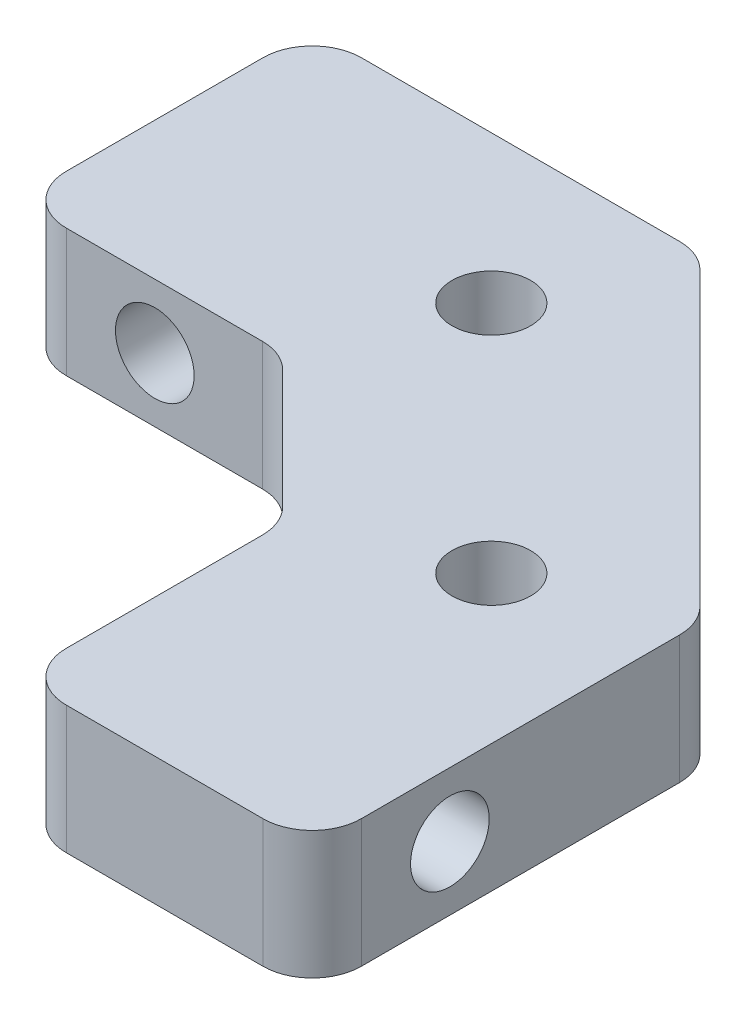
ISO-10303-21;
HEADER;
FILE_DESCRIPTION(('STEP AP214'),'2;1');
FILE_NAME('part.step','',(''),(''),'','','');
FILE_SCHEMA(('AUTOMOTIVE_DESIGN { 1 0 10303 214 1 1 1 1 }'));
ENDSEC;
DATA;
#1=APPLICATION_CONTEXT('core data for automotive mechanical design processes');
#2=APPLICATION_PROTOCOL_DEFINITION('international standard','automotive_design',2000,#1);
#3=PRODUCT_CONTEXT('',#1,'mechanical');
#4=PRODUCT('Part','Part','',(#3));
#5=PRODUCT_RELATED_PRODUCT_CATEGORY('part','',(#4));
#6=PRODUCT_DEFINITION_FORMATION('','',#4);
#7=PRODUCT_DEFINITION_CONTEXT('part definition',#1,'design');
#8=PRODUCT_DEFINITION('design','',#6,#7);
#9=PRODUCT_DEFINITION_SHAPE('','',#8);
#10=(LENGTH_UNIT() NAMED_UNIT(*) SI_UNIT(.MILLI.,.METRE.));
#11=(NAMED_UNIT(*) PLANE_ANGLE_UNIT() SI_UNIT($,.RADIAN.));
#12=(NAMED_UNIT(*) SI_UNIT($,.STERADIAN.) SOLID_ANGLE_UNIT());
#13=UNCERTAINTY_MEASURE_WITH_UNIT(LENGTH_MEASURE(1.E-05),#10,'distance_accuracy_value','');
#14=(GEOMETRIC_REPRESENTATION_CONTEXT(3) GLOBAL_UNCERTAINTY_ASSIGNED_CONTEXT((#13)) GLOBAL_UNIT_ASSIGNED_CONTEXT((#10,
#11,#12)) REPRESENTATION_CONTEXT('',''));
#15=CARTESIAN_POINT('',(0.,0.,0.));
#16=DIRECTION('',(0.,0.,1.));
#17=DIRECTION('',(1.,0.,0.));
#18=AXIS2_PLACEMENT_3D('',#15,#16,#17);
#19=CARTESIAN_POINT('',(-42.,13.,0.));
#20=DIRECTION('',(0.,-1.,0.));
#21=DIRECTION('',(0.,0.,-1.));
#22=AXIS2_PLACEMENT_3D('',#19,#20,#21);
#23=PLANE('',#22);
#24=CARTESIAN_POINT('',(-8.78679656440375,13.,-15.0000000000002));
#25=DIRECTION('',(0.,1.,0.));
#26=DIRECTION('',(0.,0.,1.));
#27=AXIS2_PLACEMENT_3D('',#24,#25,#26);
#28=CIRCLE('',#27,4.);
#29=CARTESIAN_POINT('',(-8.78679656440375,13.,-11.0000000000002));
#30=VERTEX_POINT('',#29);
#31=EDGE_CURVE('E280',#30,#30,#28,.T.);
#32=ORIENTED_EDGE('',*,*,#31,.F.);
#33=EDGE_LOOP('',(#32));
#34=FACE_BOUND('',#33,.T.);
#35=DIRECTION('',(0.,0.,1.));
#36=VECTOR('',#35,1.);
#37=CARTESIAN_POINT('',(0.,13.,42.));
#38=LINE('',#37,#36);
#39=CARTESIAN_POINT('',(0.,13.,17.0710678118655));
#40=VERTEX_POINT('',#39);
#41=CARTESIAN_POINT('',(0.,13.,37.0000000000001));
#42=VERTEX_POINT('',#41);
#43=EDGE_CURVE('E261',#40,#42,#38,.T.);
#44=ORIENTED_EDGE('',*,*,#43,.T.);
#45=CARTESIAN_POINT('',(5.,13.,37.0000000000001));
#46=DIRECTION('',(0.,-1.,0.));
#47=DIRECTION('',(0.,0.,-1.));
#48=AXIS2_PLACEMENT_3D('',#45,#46,#47);
#49=CIRCLE('',#48,5.);
#50=CARTESIAN_POINT('',(4.99999999999991,13.,42.0000000000001));
#51=VERTEX_POINT('',#50);
#52=EDGE_CURVE('E212',#42,#51,#49,.F.);
#53=ORIENTED_EDGE('',*,*,#52,.T.);
#54=DIRECTION('',(1.,0.,0.));
#55=VECTOR('',#54,1.);
#56=CARTESIAN_POINT('',(0.,13.,42.));
#57=LINE('',#56,#55);
#58=CARTESIAN_POINT('',(24.9999999999993,13.,42.0000000000005));
#59=VERTEX_POINT('',#58);
#60=EDGE_CURVE('E165',#51,#59,#57,.T.);
#61=ORIENTED_EDGE('',*,*,#60,.T.);
#62=CARTESIAN_POINT('',(24.9999999999994,13.,37.0000000000005));
#63=DIRECTION('',(0.,-1.,0.));
#64=DIRECTION('',(0.,0.,-1.));
#65=AXIS2_PLACEMENT_3D('',#62,#63,#64);
#66=CIRCLE('',#65,5.);
#67=CARTESIAN_POINT('',(29.9999999999994,13.,37.0000000000005));
#68=VERTEX_POINT('',#67);
#69=EDGE_CURVE('E210',#59,#68,#66,.F.);
#70=ORIENTED_EDGE('',*,*,#69,.T.);
#71=DIRECTION('',(0.,0.,-1.));
#72=VECTOR('',#71,1.);
#73=CARTESIAN_POINT('',(29.9999999999994,13.,2.5735931288066));
#74=LINE('',#73,#72);
#75=CARTESIAN_POINT('',(29.9999999999994,13.,4.64466094067208));
#76=VERTEX_POINT('',#75);
#77=EDGE_CURVE('E266',#68,#76,#74,.T.);
#78=ORIENTED_EDGE('',*,*,#77,.T.);
#79=CARTESIAN_POINT('',(24.9999999999994,13.,4.64466094067208));
#80=DIRECTION('',(0.,-1.,0.));
#81=DIRECTION('',(0.,0.,-1.));
#82=AXIS2_PLACEMENT_3D('',#79,#80,#81);
#83=CIRCLE('',#82,5.);
#84=CARTESIAN_POINT('',(28.5355339059322,13.,1.10912703473934));
#85=VERTEX_POINT('',#84);
#86=EDGE_CURVE('E208',#76,#85,#83,.F.);
#87=ORIENTED_EDGE('',*,*,#86,.T.);
#88=DIRECTION('',(-0.707106781186548,0.,-0.707106781186548));
#89=VECTOR('',#88,1.);
#90=CARTESIAN_POINT('',(-2.57359312880715,13.,-30.));
#91=LINE('',#90,#89);
#92=CARTESIAN_POINT('',(-1.10912703473989,13.,-28.5355339059327));
#93=VERTEX_POINT('',#92);
#94=EDGE_CURVE('E273',#85,#93,#91,.T.);
#95=ORIENTED_EDGE('',*,*,#94,.T.);
#96=CARTESIAN_POINT('',(-4.64466094067263,13.,-25.));
#97=DIRECTION('',(0.,-1.,0.));
#98=DIRECTION('',(0.,0.,-1.));
#99=AXIS2_PLACEMENT_3D('',#96,#97,#98);
#100=CIRCLE('',#99,5.);
#101=CARTESIAN_POINT('',(-4.64466094067263,13.,-30.));
#102=VERTEX_POINT('',#101);
#103=EDGE_CURVE('E206',#93,#102,#100,.F.);
#104=ORIENTED_EDGE('',*,*,#103,.T.);
#105=DIRECTION('',(-1.,0.,0.));
#106=VECTOR('',#105,1.);
#107=CARTESIAN_POINT('',(-42.,13.,-30.));
#108=LINE('',#107,#106);
#109=CARTESIAN_POINT('',(-37.,13.,-30.));
#110=VERTEX_POINT('',#109);
#111=EDGE_CURVE('E276',#102,#110,#108,.T.);
#112=ORIENTED_EDGE('',*,*,#111,.T.);
#113=CARTESIAN_POINT('',(-37.,13.,-25.));
#114=DIRECTION('',(0.,-1.,0.));
#115=DIRECTION('',(0.,0.,-1.));
#116=AXIS2_PLACEMENT_3D('',#113,#114,#115);
#117=CIRCLE('',#116,5.);
#118=CARTESIAN_POINT('',(-42.,13.,-25.));
#119=VERTEX_POINT('',#118);
#120=EDGE_CURVE('E53',#110,#119,#117,.F.);
#121=ORIENTED_EDGE('',*,*,#120,.T.);
#122=DIRECTION('',(0.,0.,1.));
#123=VECTOR('',#122,1.);
#124=CARTESIAN_POINT('',(-42.,13.,0.));
#125=LINE('',#124,#123);
#126=CARTESIAN_POINT('',(-42.,13.,-5.00000000000006));
#127=VERTEX_POINT('',#126);
#128=EDGE_CURVE('E190',#119,#127,#125,.T.);
#129=ORIENTED_EDGE('',*,*,#128,.T.);
#130=CARTESIAN_POINT('',(-37.,13.,-5.00000000000006));
#131=DIRECTION('',(0.,-1.,0.));
#132=DIRECTION('',(0.,0.,-1.));
#133=AXIS2_PLACEMENT_3D('',#130,#131,#132);
#134=CIRCLE('',#133,5.);
#135=CARTESIAN_POINT('',(-36.9999999999999,13.,0.));
#136=VERTEX_POINT('',#135);
#137=EDGE_CURVE('E203',#127,#136,#134,.F.);
#138=ORIENTED_EDGE('',*,*,#137,.T.);
#139=DIRECTION('',(1.,0.,0.));
#140=VECTOR('',#139,1.);
#141=CARTESIAN_POINT('',(-15.0000000000004,13.,-3.54334807611323E-13));
#142=LINE('',#141,#140);
#143=CARTESIAN_POINT('',(-17.0710678118659,13.,-3.26760585898465E-13));
#144=VERTEX_POINT('',#143);
#145=EDGE_CURVE('E189',#136,#144,#142,.T.);
#146=ORIENTED_EDGE('',*,*,#145,.T.);
#147=CARTESIAN_POINT('',(-17.0710678118658,13.,4.99999999999967));
#148=DIRECTION('',(0.,-1.,0.));
#149=DIRECTION('',(0.,0.,-1.));
#150=AXIS2_PLACEMENT_3D('',#147,#148,#149);
#151=CIRCLE('',#150,5.);
#152=CARTESIAN_POINT('',(-13.5355339059331,13.,1.46446609406693));
#153=VERTEX_POINT('',#152);
#154=EDGE_CURVE('E245',#144,#153,#151,.T.);
#155=ORIENTED_EDGE('',*,*,#154,.T.);
#156=DIRECTION('',(0.707106781186548,0.,0.707106781186547));
#157=VECTOR('',#156,1.);
#158=CARTESIAN_POINT('',(0.,13.,15.));
#159=LINE('',#158,#157);
#160=CARTESIAN_POINT('',(-1.46446609406726,13.,13.5355339059327));
#161=VERTEX_POINT('',#160);
#162=EDGE_CURVE('E262',#153,#161,#159,.T.);
#163=ORIENTED_EDGE('',*,*,#162,.T.);
#164=CARTESIAN_POINT('',(-5.,13.,17.0710678118655));
#165=DIRECTION('',(0.,-1.,0.));
#166=DIRECTION('',(0.,0.,-1.));
#167=AXIS2_PLACEMENT_3D('',#164,#165,#166);
#168=CIRCLE('',#167,5.);
#169=EDGE_CURVE('E11',#161,#40,#168,.T.);
#170=ORIENTED_EDGE('',*,*,#169,.T.);
#171=EDGE_LOOP('',(#44,#53,#61,#70,#78,#87,#95,#104,#112,#121,#129,#138,#146,#155,#163,#170));
#172=FACE_BOUND('',#171,.T.);
#173=CARTESIAN_POINT('',(14.9999999999997,13.,8.7867965644033));
#174=DIRECTION('',(0.,1.,0.));
#175=DIRECTION('',(0.,0.,1.));
#176=AXIS2_PLACEMENT_3D('',#173,#174,#175);
#177=CIRCLE('',#176,4.);
#178=CARTESIAN_POINT('',(14.9999999999997,13.,12.7867965644033));
#179=VERTEX_POINT('',#178);
#180=EDGE_CURVE('E290',#179,#179,#177,.T.);
#181=ORIENTED_EDGE('',*,*,#180,.F.);
#182=EDGE_LOOP('',(#181));
#183=FACE_BOUND('',#182,.T.);
#184=ADVANCED_FACE('F31',(#34,#172,#183),#23,.F.);
#185=CARTESIAN_POINT('',(-42.,0.,0.));
#186=DIRECTION('',(0.,-1.,0.));
#187=DIRECTION('',(0.,0.,-1.));
#188=AXIS2_PLACEMENT_3D('',#185,#186,#187);
#189=PLANE('',#188);
#190=CARTESIAN_POINT('',(-8.78679656440375,0.,-15.0000000000002));
#191=DIRECTION('',(0.,1.,0.));
#192=DIRECTION('',(0.,0.,1.));
#193=AXIS2_PLACEMENT_3D('',#190,#191,#192);
#194=CIRCLE('',#193,4.);
#195=CARTESIAN_POINT('',(-8.78679656440375,0.,-11.0000000000002));
#196=VERTEX_POINT('',#195);
#197=EDGE_CURVE('E285',#196,#196,#194,.T.);
#198=ORIENTED_EDGE('',*,*,#197,.T.);
#199=EDGE_LOOP('',(#198));
#200=FACE_BOUND('',#199,.T.);
#201=DIRECTION('',(1.,0.,0.));
#202=VECTOR('',#201,1.);
#203=CARTESIAN_POINT('',(0.,0.,42.));
#204=LINE('',#203,#202);
#205=CARTESIAN_POINT('',(4.99999999999991,0.,42.0000000000001));
#206=VERTEX_POINT('',#205);
#207=CARTESIAN_POINT('',(24.9999999999993,0.,42.0000000000005));
#208=VERTEX_POINT('',#207);
#209=EDGE_CURVE('E162',#206,#208,#204,.T.);
#210=ORIENTED_EDGE('',*,*,#209,.F.);
#211=CARTESIAN_POINT('',(5.,0.,37.0000000000001));
#212=DIRECTION('',(0.,-1.,0.));
#213=DIRECTION('',(0.,0.,-1.));
#214=AXIS2_PLACEMENT_3D('',#211,#212,#213);
#215=CIRCLE('',#214,5.);
#216=CARTESIAN_POINT('',(0.,0.,37.0000000000001));
#217=VERTEX_POINT('',#216);
#218=EDGE_CURVE('E145',#206,#217,#215,.T.);
#219=ORIENTED_EDGE('',*,*,#218,.T.);
#220=DIRECTION('',(0.,0.,1.));
#221=VECTOR('',#220,1.);
#222=CARTESIAN_POINT('',(0.,0.,42.));
#223=LINE('',#222,#221);
#224=CARTESIAN_POINT('',(0.,0.,17.0710678118655));
#225=VERTEX_POINT('',#224);
#226=EDGE_CURVE('E173',#225,#217,#223,.T.);
#227=ORIENTED_EDGE('',*,*,#226,.F.);
#228=CARTESIAN_POINT('',(-5.,0.,17.0710678118655));
#229=DIRECTION('',(0.,-1.,0.));
#230=DIRECTION('',(0.,0.,-1.));
#231=AXIS2_PLACEMENT_3D('',#228,#229,#230);
#232=CIRCLE('',#231,5.);
#233=CARTESIAN_POINT('',(-1.46446609406726,0.,13.5355339059327));
#234=VERTEX_POINT('',#233);
#235=EDGE_CURVE('E39',#225,#234,#232,.F.);
#236=ORIENTED_EDGE('',*,*,#235,.T.);
#237=DIRECTION('',(0.707106781186548,0.,0.707106781186547));
#238=VECTOR('',#237,1.);
#239=CARTESIAN_POINT('',(0.,0.,15.));
#240=LINE('',#239,#238);
#241=CARTESIAN_POINT('',(-13.5355339059331,0.,1.46446609406693));
#242=VERTEX_POINT('',#241);
#243=EDGE_CURVE('E178',#242,#234,#240,.T.);
#244=ORIENTED_EDGE('',*,*,#243,.F.);
#245=CARTESIAN_POINT('',(-17.0710678118658,0.,4.99999999999967));
#246=DIRECTION('',(0.,-1.,0.));
#247=DIRECTION('',(0.,0.,-1.));
#248=AXIS2_PLACEMENT_3D('',#245,#246,#247);
#249=CIRCLE('',#248,5.);
#250=CARTESIAN_POINT('',(-17.0710678118659,0.,-3.26760585898465E-13));
#251=VERTEX_POINT('',#250);
#252=EDGE_CURVE('E243',#242,#251,#249,.F.);
#253=ORIENTED_EDGE('',*,*,#252,.T.);
#254=DIRECTION('',(1.,0.,0.));
#255=VECTOR('',#254,1.);
#256=CARTESIAN_POINT('',(-15.0000000000004,0.,-3.54334807611323E-13));
#257=LINE('',#256,#255);
#258=CARTESIAN_POINT('',(-36.9999999999999,0.,0.));
#259=VERTEX_POINT('',#258);
#260=EDGE_CURVE('E256',#259,#251,#257,.T.);
#261=ORIENTED_EDGE('',*,*,#260,.F.);
#262=CARTESIAN_POINT('',(-37.,0.,-5.00000000000006));
#263=DIRECTION('',(0.,-1.,0.));
#264=DIRECTION('',(0.,0.,-1.));
#265=AXIS2_PLACEMENT_3D('',#262,#263,#264);
#266=CIRCLE('',#265,5.);
#267=CARTESIAN_POINT('',(-42.,0.,-5.00000000000006));
#268=VERTEX_POINT('',#267);
#269=EDGE_CURVE('E166',#259,#268,#266,.T.);
#270=ORIENTED_EDGE('',*,*,#269,.T.);
#271=DIRECTION('',(0.,0.,1.));
#272=VECTOR('',#271,1.);
#273=CARTESIAN_POINT('',(-42.,0.,0.));
#274=LINE('',#273,#272);
#275=CARTESIAN_POINT('',(-42.,0.,-25.));
#276=VERTEX_POINT('',#275);
#277=EDGE_CURVE('E187',#276,#268,#274,.T.);
#278=ORIENTED_EDGE('',*,*,#277,.F.);
#279=CARTESIAN_POINT('',(-37.,0.,-25.));
#280=DIRECTION('',(0.,-1.,0.));
#281=DIRECTION('',(0.,0.,-1.));
#282=AXIS2_PLACEMENT_3D('',#279,#280,#281);
#283=CIRCLE('',#282,5.);
#284=CARTESIAN_POINT('',(-37.,0.,-30.));
#285=VERTEX_POINT('',#284);
#286=EDGE_CURVE('E193',#276,#285,#283,.T.);
#287=ORIENTED_EDGE('',*,*,#286,.T.);
#288=DIRECTION('',(-1.,0.,0.));
#289=VECTOR('',#288,1.);
#290=CARTESIAN_POINT('',(-42.,0.,-30.));
#291=LINE('',#290,#289);
#292=CARTESIAN_POINT('',(-4.64466094067263,0.,-30.));
#293=VERTEX_POINT('',#292);
#294=EDGE_CURVE('E184',#293,#285,#291,.T.);
#295=ORIENTED_EDGE('',*,*,#294,.F.);
#296=CARTESIAN_POINT('',(-4.64466094067263,0.,-25.));
#297=DIRECTION('',(0.,-1.,0.));
#298=DIRECTION('',(0.,0.,-1.));
#299=AXIS2_PLACEMENT_3D('',#296,#297,#298);
#300=CIRCLE('',#299,5.);
#301=CARTESIAN_POINT('',(-1.10912703473989,0.,-28.5355339059327));
#302=VERTEX_POINT('',#301);
#303=EDGE_CURVE('E195',#293,#302,#300,.T.);
#304=ORIENTED_EDGE('',*,*,#303,.T.);
#305=DIRECTION('',(-0.707106781186548,0.,-0.707106781186548));
#306=VECTOR('',#305,1.);
#307=CARTESIAN_POINT('',(-2.57359312880715,0.,-30.));
#308=LINE('',#307,#306);
#309=CARTESIAN_POINT('',(28.5355339059322,0.,1.10912703473934));
#310=VERTEX_POINT('',#309);
#311=EDGE_CURVE('E176',#310,#302,#308,.T.);
#312=ORIENTED_EDGE('',*,*,#311,.F.);
#313=CARTESIAN_POINT('',(24.9999999999994,0.,4.64466094067208));
#314=DIRECTION('',(0.,-1.,0.));
#315=DIRECTION('',(0.,0.,-1.));
#316=AXIS2_PLACEMENT_3D('',#313,#314,#315);
#317=CIRCLE('',#316,5.);
#318=CARTESIAN_POINT('',(29.9999999999994,0.,4.64466094067208));
#319=VERTEX_POINT('',#318);
#320=EDGE_CURVE('E197',#310,#319,#317,.T.);
#321=ORIENTED_EDGE('',*,*,#320,.T.);
#322=DIRECTION('',(0.,0.,-1.));
#323=VECTOR('',#322,1.);
#324=CARTESIAN_POINT('',(29.9999999999994,0.,2.5735931288066));
#325=LINE('',#324,#323);
#326=CARTESIAN_POINT('',(29.9999999999994,0.,37.0000000000005));
#327=VERTEX_POINT('',#326);
#328=EDGE_CURVE('E172',#327,#319,#325,.T.);
#329=ORIENTED_EDGE('',*,*,#328,.F.);
#330=CARTESIAN_POINT('',(24.9999999999994,0.,37.0000000000005));
#331=DIRECTION('',(0.,-1.,0.));
#332=DIRECTION('',(0.,0.,-1.));
#333=AXIS2_PLACEMENT_3D('',#330,#331,#332);
#334=CIRCLE('',#333,5.);
#335=EDGE_CURVE('E156',#327,#208,#334,.T.);
#336=ORIENTED_EDGE('',*,*,#335,.T.);
#337=EDGE_LOOP('',(#210,#219,#227,#236,#244,#253,#261,#270,#278,#287,#295,#304,#312,#321,#329,#336));
#338=FACE_BOUND('',#337,.T.);
#339=CARTESIAN_POINT('',(14.9999999999997,0.,8.7867965644033));
#340=DIRECTION('',(0.,1.,0.));
#341=DIRECTION('',(0.,0.,1.));
#342=AXIS2_PLACEMENT_3D('',#339,#340,#341);
#343=CIRCLE('',#342,4.);
#344=CARTESIAN_POINT('',(14.9999999999997,0.,12.7867965644033));
#345=VERTEX_POINT('',#344);
#346=EDGE_CURVE('E293',#345,#345,#343,.T.);
#347=ORIENTED_EDGE('',*,*,#346,.T.);
#348=EDGE_LOOP('',(#347));
#349=FACE_BOUND('',#348,.T.);
#350=ADVANCED_FACE('F169',(#200,#338,#349),#189,.T.);
#351=CARTESIAN_POINT('',(-15.0000000000004,13.,-3.54334807611323E-13));
#352=DIRECTION('',(0.,0.,-1.));
#353=DIRECTION('',(-1.,0.,0.));
#354=AXIS2_PLACEMENT_3D('',#351,#352,#353);
#355=PLANE('',#354);
#356=CARTESIAN_POINT('',(-27.9999999999999,6.5,0.));
#357=DIRECTION('',(0.,0.,1.));
#358=DIRECTION('',(1.,0.,0.));
#359=AXIS2_PLACEMENT_3D('',#356,#357,#358);
#360=CIRCLE('',#359,4.);
#361=CARTESIAN_POINT('',(-23.9999999999999,6.5,0.));
#362=VERTEX_POINT('',#361);
#363=EDGE_CURVE('E357',#362,#362,#360,.T.);
#364=ORIENTED_EDGE('',*,*,#363,.F.);
#365=EDGE_LOOP('',(#364));
#366=FACE_BOUND('',#365,.T.);
#367=ORIENTED_EDGE('',*,*,#145,.F.);
#368=DIRECTION('',(0.,-1.,0.));
#369=VECTOR('',#368,1.);
#370=CARTESIAN_POINT('',(-36.9999999999999,13.,0.));
#371=LINE('',#370,#369);
#372=EDGE_CURVE('E235',#136,#259,#371,.T.);
#373=ORIENTED_EDGE('',*,*,#372,.T.);
#374=ORIENTED_EDGE('',*,*,#260,.T.);
#375=DIRECTION('',(0.,-1.,0.));
#376=VECTOR('',#375,1.);
#377=CARTESIAN_POINT('',(-17.0710678118659,13.,-3.26760585898465E-13));
#378=LINE('',#377,#376);
#379=EDGE_CURVE('E233',#251,#144,#378,.F.);
#380=ORIENTED_EDGE('',*,*,#379,.T.);
#381=EDGE_LOOP('',(#367,#373,#374,#380));
#382=FACE_BOUND('',#381,.T.);
#383=ADVANCED_FACE('F307',(#366,#382),#355,.F.);
#384=CARTESIAN_POINT('',(0.,13.,15.));
#385=DIRECTION('',(0.707106781186547,0.,-0.707106781186548));
#386=DIRECTION('',(-0.707106781186548,0.,-0.707106781186547));
#387=AXIS2_PLACEMENT_3D('',#384,#385,#386);
#388=PLANE('',#387);
#389=CARTESIAN_POINT('',(-7.5,6.5,7.5));
#390=DIRECTION('',(-0.707106781186548,0.,0.707106781186548));
#391=DIRECTION('',(0.707106781186548,0.,0.707106781186548));
#392=AXIS2_PLACEMENT_3D('',#389,#390,#391);
#393=CIRCLE('',#392,4.);
#394=CARTESIAN_POINT('',(-4.67157287525381,6.5,10.3284271247462));
#395=VERTEX_POINT('',#394);
#396=EDGE_CURVE('E363',#395,#395,#393,.T.);
#397=ORIENTED_EDGE('',*,*,#396,.F.);
#398=EDGE_LOOP('',(#397));
#399=FACE_BOUND('',#398,.T.);
#400=ORIENTED_EDGE('',*,*,#162,.F.);
#401=DIRECTION('',(0.,-1.,0.));
#402=VECTOR('',#401,1.);
#403=CARTESIAN_POINT('',(-13.5355339059331,0.,1.46446609406693));
#404=LINE('',#403,#402);
#405=EDGE_CURVE('E240',#153,#242,#404,.T.);
#406=ORIENTED_EDGE('',*,*,#405,.T.);
#407=ORIENTED_EDGE('',*,*,#243,.T.);
#408=DIRECTION('',(0.,-1.,0.));
#409=VECTOR('',#408,1.);
#410=CARTESIAN_POINT('',(-1.46446609406726,13.,13.5355339059327));
#411=LINE('',#410,#409);
#412=EDGE_CURVE('E238',#234,#161,#411,.F.);
#413=ORIENTED_EDGE('',*,*,#412,.T.);
#414=EDGE_LOOP('',(#400,#406,#407,#413));
#415=FACE_BOUND('',#414,.T.);
#416=ADVANCED_FACE('F253',(#399,#415),#388,.F.);
#417=CARTESIAN_POINT('',(0.,13.,42.));
#418=DIRECTION('',(1.,0.,0.));
#419=DIRECTION('',(0.,0.,-1.));
#420=AXIS2_PLACEMENT_3D('',#417,#418,#419);
#421=PLANE('',#420);
#422=CARTESIAN_POINT('',(0.,6.5,28.0000000000001));
#423=DIRECTION('',(-1.,0.,0.));
#424=DIRECTION('',(0.,0.,1.));
#425=AXIS2_PLACEMENT_3D('',#422,#423,#424);
#426=CIRCLE('',#425,4.);
#427=CARTESIAN_POINT('',(0.,6.5,32.0000000000001));
#428=VERTEX_POINT('',#427);
#429=EDGE_CURVE('E352',#428,#428,#426,.T.);
#430=ORIENTED_EDGE('',*,*,#429,.F.);
#431=EDGE_LOOP('',(#430));
#432=FACE_BOUND('',#431,.T.);
#433=ORIENTED_EDGE('',*,*,#226,.T.);
#434=DIRECTION('',(0.,-1.,0.));
#435=VECTOR('',#434,1.);
#436=CARTESIAN_POINT('',(0.,13.,37.0000000000001));
#437=LINE('',#436,#435);
#438=EDGE_CURVE('E150',#217,#42,#437,.F.);
#439=ORIENTED_EDGE('',*,*,#438,.T.);
#440=ORIENTED_EDGE('',*,*,#43,.F.);
#441=DIRECTION('',(0.,-1.,0.));
#442=VECTOR('',#441,1.);
#443=CARTESIAN_POINT('',(0.,0.,17.0710678118655));
#444=LINE('',#443,#442);
#445=EDGE_CURVE('E155',#40,#225,#444,.T.);
#446=ORIENTED_EDGE('',*,*,#445,.T.);
#447=EDGE_LOOP('',(#433,#439,#440,#446));
#448=FACE_BOUND('',#447,.T.);
#449=ADVANCED_FACE('F264',(#432,#448),#421,.F.);
#450=CARTESIAN_POINT('',(0.,13.,42.));
#451=DIRECTION('',(0.,0.,-1.));
#452=DIRECTION('',(-1.,0.,0.));
#453=AXIS2_PLACEMENT_3D('',#450,#451,#452);
#454=PLANE('',#453);
#455=ORIENTED_EDGE('',*,*,#60,.F.);
#456=DIRECTION('',(0.,-1.,0.));
#457=VECTOR('',#456,1.);
#458=CARTESIAN_POINT('',(4.99999999999991,13.,42.0000000000001));
#459=LINE('',#458,#457);
#460=EDGE_CURVE('E149',#51,#206,#459,.T.);
#461=ORIENTED_EDGE('',*,*,#460,.T.);
#462=ORIENTED_EDGE('',*,*,#209,.T.);
#463=DIRECTION('',(0.,-1.,0.));
#464=VECTOR('',#463,1.);
#465=CARTESIAN_POINT('',(24.9999999999993,13.,42.0000000000005));
#466=LINE('',#465,#464);
#467=EDGE_CURVE('E167',#208,#59,#466,.F.);
#468=ORIENTED_EDGE('',*,*,#467,.T.);
#469=EDGE_LOOP('',(#455,#461,#462,#468));
#470=FACE_BOUND('',#469,.T.);
#471=ADVANCED_FACE('F161',(#470),#454,.F.);
#472=CARTESIAN_POINT('',(29.9999999999994,13.,2.5735931288066));
#473=DIRECTION('',(-1.,0.,0.));
#474=DIRECTION('',(0.,0.,1.));
#475=AXIS2_PLACEMENT_3D('',#472,#473,#474);
#476=PLANE('',#475);
#477=CARTESIAN_POINT('',(30.,6.5,28.0000000000001));
#478=DIRECTION('',(-1.,0.,0.));
#479=DIRECTION('',(0.,0.,1.));
#480=AXIS2_PLACEMENT_3D('',#477,#478,#479);
#481=CIRCLE('',#480,4.);
#482=CARTESIAN_POINT('',(30.,6.5,32.0000000000001));
#483=VERTEX_POINT('',#482);
#484=EDGE_CURVE('E354',#483,#483,#481,.T.);
#485=ORIENTED_EDGE('',*,*,#484,.T.);
#486=EDGE_LOOP('',(#485));
#487=FACE_BOUND('',#486,.T.);
#488=ORIENTED_EDGE('',*,*,#77,.F.);
#489=DIRECTION('',(0.,-1.,0.));
#490=VECTOR('',#489,1.);
#491=CARTESIAN_POINT('',(29.9999999999994,13.,37.0000000000005));
#492=LINE('',#491,#490);
#493=EDGE_CURVE('E216',#68,#327,#492,.T.);
#494=ORIENTED_EDGE('',*,*,#493,.T.);
#495=ORIENTED_EDGE('',*,*,#328,.T.);
#496=DIRECTION('',(0.,-1.,0.));
#497=VECTOR('',#496,1.);
#498=CARTESIAN_POINT('',(29.9999999999994,13.,4.64466094067208));
#499=LINE('',#498,#497);
#500=EDGE_CURVE('E214',#319,#76,#499,.F.);
#501=ORIENTED_EDGE('',*,*,#500,.T.);
#502=EDGE_LOOP('',(#488,#494,#495,#501));
#503=FACE_BOUND('',#502,.T.);
#504=ADVANCED_FACE('F339',(#487,#503),#476,.F.);
#505=CARTESIAN_POINT('',(-2.57359312880715,13.,-30.));
#506=DIRECTION('',(-0.707106781186548,0.,0.707106781186548));
#507=DIRECTION('',(0.707106781186548,0.,0.707106781186548));
#508=AXIS2_PLACEMENT_3D('',#505,#506,#507);
#509=PLANE('',#508);
#510=CARTESIAN_POINT('',(13.7132034355964,6.5,-13.7132034355964));
#511=DIRECTION('',(-0.707106781186548,0.,0.707106781186548));
#512=DIRECTION('',(0.707106781186548,0.,0.707106781186548));
#513=AXIS2_PLACEMENT_3D('',#510,#511,#512);
#514=CIRCLE('',#513,4.);
#515=CARTESIAN_POINT('',(16.5416305603426,6.5,-10.8847763108502));
#516=VERTEX_POINT('',#515);
#517=EDGE_CURVE('E366',#516,#516,#514,.T.);
#518=ORIENTED_EDGE('',*,*,#517,.T.);
#519=EDGE_LOOP('',(#518));
#520=FACE_BOUND('',#519,.T.);
#521=ORIENTED_EDGE('',*,*,#94,.F.);
#522=DIRECTION('',(0.,-1.,0.));
#523=VECTOR('',#522,1.);
#524=CARTESIAN_POINT('',(28.5355339059322,13.,1.10912703473934));
#525=LINE('',#524,#523);
#526=EDGE_CURVE('E221',#85,#310,#525,.T.);
#527=ORIENTED_EDGE('',*,*,#526,.T.);
#528=ORIENTED_EDGE('',*,*,#311,.T.);
#529=DIRECTION('',(0.,-1.,0.));
#530=VECTOR('',#529,1.);
#531=CARTESIAN_POINT('',(-1.10912703473989,13.,-28.5355339059327));
#532=LINE('',#531,#530);
#533=EDGE_CURVE('E219',#302,#93,#532,.F.);
#534=ORIENTED_EDGE('',*,*,#533,.T.);
#535=EDGE_LOOP('',(#521,#527,#528,#534));
#536=FACE_BOUND('',#535,.T.);
#537=ADVANCED_FACE('F335',(#520,#536),#509,.F.);
#538=CARTESIAN_POINT('',(-42.,13.,-30.));
#539=DIRECTION('',(0.,0.,1.));
#540=DIRECTION('',(1.,0.,0.));
#541=AXIS2_PLACEMENT_3D('',#538,#539,#540);
#542=PLANE('',#541);
#543=CARTESIAN_POINT('',(-27.9999999999999,6.5,-30.));
#544=DIRECTION('',(0.,0.,1.));
#545=DIRECTION('',(1.,0.,0.));
#546=AXIS2_PLACEMENT_3D('',#543,#544,#545);
#547=CIRCLE('',#546,4.);
#548=CARTESIAN_POINT('',(-23.9999999999999,6.5,-30.));
#549=VERTEX_POINT('',#548);
#550=EDGE_CURVE('E360',#549,#549,#547,.T.);
#551=ORIENTED_EDGE('',*,*,#550,.T.);
#552=EDGE_LOOP('',(#551));
#553=FACE_BOUND('',#552,.T.);
#554=ORIENTED_EDGE('',*,*,#111,.F.);
#555=DIRECTION('',(0.,-1.,0.));
#556=VECTOR('',#555,1.);
#557=CARTESIAN_POINT('',(-4.64466094067263,13.,-30.));
#558=LINE('',#557,#556);
#559=EDGE_CURVE('E226',#102,#293,#558,.T.);
#560=ORIENTED_EDGE('',*,*,#559,.T.);
#561=ORIENTED_EDGE('',*,*,#294,.T.);
#562=DIRECTION('',(0.,-1.,0.));
#563=VECTOR('',#562,1.);
#564=CARTESIAN_POINT('',(-37.,13.,-30.));
#565=LINE('',#564,#563);
#566=EDGE_CURVE('E224',#285,#110,#565,.F.);
#567=ORIENTED_EDGE('',*,*,#566,.T.);
#568=EDGE_LOOP('',(#554,#560,#561,#567));
#569=FACE_BOUND('',#568,.T.);
#570=ADVANCED_FACE('F332',(#553,#569),#542,.F.);
#571=CARTESIAN_POINT('',(-42.,13.,0.));
#572=DIRECTION('',(1.,0.,0.));
#573=DIRECTION('',(0.,0.,-1.));
#574=AXIS2_PLACEMENT_3D('',#571,#572,#573);
#575=PLANE('',#574);
#576=ORIENTED_EDGE('',*,*,#128,.F.);
#577=DIRECTION('',(0.,-1.,0.));
#578=VECTOR('',#577,1.);
#579=CARTESIAN_POINT('',(-42.,13.,-25.));
#580=LINE('',#579,#578);
#581=EDGE_CURVE('E230',#119,#276,#580,.T.);
#582=ORIENTED_EDGE('',*,*,#581,.T.);
#583=ORIENTED_EDGE('',*,*,#277,.T.);
#584=DIRECTION('',(0.,-1.,0.));
#585=VECTOR('',#584,1.);
#586=CARTESIAN_POINT('',(-42.,13.,-5.00000000000006));
#587=LINE('',#586,#585);
#588=EDGE_CURVE('E46',#268,#127,#587,.F.);
#589=ORIENTED_EDGE('',*,*,#588,.T.);
#590=EDGE_LOOP('',(#576,#582,#583,#589));
#591=FACE_BOUND('',#590,.T.);
#592=ADVANCED_FACE('F304',(#591),#575,.F.);
#593=CARTESIAN_POINT('',(-8.78679656440375,13.,-15.0000000000002));
#594=DIRECTION('',(0.,-1.,0.));
#595=DIRECTION('',(0.,0.,-1.));
#596=AXIS2_PLACEMENT_3D('',#593,#594,#595);
#597=CYLINDRICAL_SURFACE('',#596,4.);
#598=ORIENTED_EDGE('',*,*,#31,.T.);
#599=EDGE_LOOP('',(#598));
#600=FACE_BOUND('',#599,.T.);
#601=ORIENTED_EDGE('',*,*,#197,.F.);
#602=EDGE_LOOP('',(#601));
#603=FACE_BOUND('',#602,.T.);
#604=ADVANCED_FACE('F327',(#600,#603),#597,.F.);
#605=CARTESIAN_POINT('',(14.9999999999997,13.,8.7867965644033));
#606=DIRECTION('',(0.,-1.,0.));
#607=DIRECTION('',(0.,0.,-1.));
#608=AXIS2_PLACEMENT_3D('',#605,#606,#607);
#609=CYLINDRICAL_SURFACE('',#608,4.);
#610=ORIENTED_EDGE('',*,*,#180,.T.);
#611=EDGE_LOOP('',(#610));
#612=FACE_BOUND('',#611,.T.);
#613=ORIENTED_EDGE('',*,*,#346,.F.);
#614=EDGE_LOOP('',(#613));
#615=FACE_BOUND('',#614,.T.);
#616=ADVANCED_FACE('F376',(#612,#615),#609,.F.);
#617=CARTESIAN_POINT('',(5.,13.,37.0000000000001));
#618=DIRECTION('',(0.,-1.,0.));
#619=DIRECTION('',(0.,0.,-1.));
#620=AXIS2_PLACEMENT_3D('',#617,#618,#619);
#621=CYLINDRICAL_SURFACE('',#620,5.);
#622=ORIENTED_EDGE('',*,*,#52,.F.);
#623=ORIENTED_EDGE('',*,*,#438,.F.);
#624=ORIENTED_EDGE('',*,*,#218,.F.);
#625=ORIENTED_EDGE('',*,*,#460,.F.);
#626=EDGE_LOOP('',(#622,#623,#624,#625));
#627=FACE_BOUND('',#626,.T.);
#628=ADVANCED_FACE('F148',(#627),#621,.T.);
#629=CARTESIAN_POINT('',(24.9999999999994,13.,37.0000000000005));
#630=DIRECTION('',(0.,-1.,0.));
#631=DIRECTION('',(0.,0.,-1.));
#632=AXIS2_PLACEMENT_3D('',#629,#630,#631);
#633=CYLINDRICAL_SURFACE('',#632,5.);
#634=ORIENTED_EDGE('',*,*,#69,.F.);
#635=ORIENTED_EDGE('',*,*,#467,.F.);
#636=ORIENTED_EDGE('',*,*,#335,.F.);
#637=ORIENTED_EDGE('',*,*,#493,.F.);
#638=EDGE_LOOP('',(#634,#635,#636,#637));
#639=FACE_BOUND('',#638,.T.);
#640=ADVANCED_FACE('F382',(#639),#633,.T.);
#641=CARTESIAN_POINT('',(24.9999999999994,13.,4.64466094067208));
#642=DIRECTION('',(0.,-1.,0.));
#643=DIRECTION('',(0.,0.,-1.));
#644=AXIS2_PLACEMENT_3D('',#641,#642,#643);
#645=CYLINDRICAL_SURFACE('',#644,5.);
#646=ORIENTED_EDGE('',*,*,#86,.F.);
#647=ORIENTED_EDGE('',*,*,#500,.F.);
#648=ORIENTED_EDGE('',*,*,#320,.F.);
#649=ORIENTED_EDGE('',*,*,#526,.F.);
#650=EDGE_LOOP('',(#646,#647,#648,#649));
#651=FACE_BOUND('',#650,.T.);
#652=ADVANCED_FACE('F406',(#651),#645,.T.);
#653=CARTESIAN_POINT('',(-4.64466094067263,13.,-25.));
#654=DIRECTION('',(0.,-1.,0.));
#655=DIRECTION('',(0.,0.,-1.));
#656=AXIS2_PLACEMENT_3D('',#653,#654,#655);
#657=CYLINDRICAL_SURFACE('',#656,5.);
#658=ORIENTED_EDGE('',*,*,#103,.F.);
#659=ORIENTED_EDGE('',*,*,#533,.F.);
#660=ORIENTED_EDGE('',*,*,#303,.F.);
#661=ORIENTED_EDGE('',*,*,#559,.F.);
#662=EDGE_LOOP('',(#658,#659,#660,#661));
#663=FACE_BOUND('',#662,.T.);
#664=ADVANCED_FACE('F411',(#663),#657,.T.);
#665=CARTESIAN_POINT('',(-37.,13.,-25.));
#666=DIRECTION('',(0.,-1.,0.));
#667=DIRECTION('',(0.,0.,-1.));
#668=AXIS2_PLACEMENT_3D('',#665,#666,#667);
#669=CYLINDRICAL_SURFACE('',#668,5.);
#670=ORIENTED_EDGE('',*,*,#120,.F.);
#671=ORIENTED_EDGE('',*,*,#566,.F.);
#672=ORIENTED_EDGE('',*,*,#286,.F.);
#673=ORIENTED_EDGE('',*,*,#581,.F.);
#674=EDGE_LOOP('',(#670,#671,#672,#673));
#675=FACE_BOUND('',#674,.T.);
#676=ADVANCED_FACE('F417',(#675),#669,.T.);
#677=CARTESIAN_POINT('',(-37.,13.,-5.00000000000006));
#678=DIRECTION('',(0.,-1.,0.));
#679=DIRECTION('',(0.,0.,-1.));
#680=AXIS2_PLACEMENT_3D('',#677,#678,#679);
#681=CYLINDRICAL_SURFACE('',#680,5.);
#682=ORIENTED_EDGE('',*,*,#137,.F.);
#683=ORIENTED_EDGE('',*,*,#588,.F.);
#684=ORIENTED_EDGE('',*,*,#269,.F.);
#685=ORIENTED_EDGE('',*,*,#372,.F.);
#686=EDGE_LOOP('',(#682,#683,#684,#685));
#687=FACE_BOUND('',#686,.T.);
#688=ADVANCED_FACE('F306',(#687),#681,.T.);
#689=CARTESIAN_POINT('',(-17.0710678118658,13.,4.99999999999967));
#690=DIRECTION('',(0.,1.,0.));
#691=DIRECTION('',(0.,0.,1.));
#692=AXIS2_PLACEMENT_3D('',#689,#690,#691);
#693=CYLINDRICAL_SURFACE('',#692,5.);
#694=ORIENTED_EDGE('',*,*,#154,.F.);
#695=ORIENTED_EDGE('',*,*,#379,.F.);
#696=ORIENTED_EDGE('',*,*,#252,.F.);
#697=ORIENTED_EDGE('',*,*,#405,.F.);
#698=EDGE_LOOP('',(#694,#695,#696,#697));
#699=FACE_BOUND('',#698,.T.);
#700=ADVANCED_FACE('F301',(#699),#693,.F.);
#701=CARTESIAN_POINT('',(-5.,13.,17.0710678118655));
#702=DIRECTION('',(0.,1.,0.));
#703=DIRECTION('',(0.,0.,1.));
#704=AXIS2_PLACEMENT_3D('',#701,#702,#703);
#705=CYLINDRICAL_SURFACE('',#704,5.);
#706=ORIENTED_EDGE('',*,*,#169,.F.);
#707=ORIENTED_EDGE('',*,*,#412,.F.);
#708=ORIENTED_EDGE('',*,*,#235,.F.);
#709=ORIENTED_EDGE('',*,*,#445,.F.);
#710=EDGE_LOOP('',(#706,#707,#708,#709));
#711=FACE_BOUND('',#710,.T.);
#712=ADVANCED_FACE('F33',(#711),#705,.F.);
#713=CARTESIAN_POINT('',(13.7132034355964,6.5,-13.7132034355964));
#714=DIRECTION('',(-0.707106781186547,0.,0.707106781186547));
#715=DIRECTION('',(0.707106781186548,0.,0.707106781186548));
#716=AXIS2_PLACEMENT_3D('',#713,#714,#715);
#717=CYLINDRICAL_SURFACE('',#716,4.);
#718=ORIENTED_EDGE('',*,*,#517,.F.);
#719=EDGE_LOOP('',(#718));
#720=FACE_BOUND('',#719,.T.);
#721=ORIENTED_EDGE('',*,*,#396,.T.);
#722=EDGE_LOOP('',(#721));
#723=FACE_BOUND('',#722,.T.);
#724=ADVANCED_FACE('F384',(#720,#723),#717,.F.);
#725=CARTESIAN_POINT('',(-27.9999999999999,6.5,-30.));
#726=DIRECTION('',(0.,0.,1.));
#727=DIRECTION('',(1.,0.,0.));
#728=AXIS2_PLACEMENT_3D('',#725,#726,#727);
#729=CYLINDRICAL_SURFACE('',#728,4.);
#730=ORIENTED_EDGE('',*,*,#550,.F.);
#731=EDGE_LOOP('',(#730));
#732=FACE_BOUND('',#731,.T.);
#733=ORIENTED_EDGE('',*,*,#363,.T.);
#734=EDGE_LOOP('',(#733));
#735=FACE_BOUND('',#734,.T.);
#736=ADVANCED_FACE('F387',(#732,#735),#729,.F.);
#737=CARTESIAN_POINT('',(30.,6.5,28.0000000000001));
#738=DIRECTION('',(-1.,0.,0.));
#739=DIRECTION('',(0.,0.,1.));
#740=AXIS2_PLACEMENT_3D('',#737,#738,#739);
#741=CYLINDRICAL_SURFACE('',#740,4.);
#742=ORIENTED_EDGE('',*,*,#484,.F.);
#743=EDGE_LOOP('',(#742));
#744=FACE_BOUND('',#743,.T.);
#745=ORIENTED_EDGE('',*,*,#429,.T.);
#746=EDGE_LOOP('',(#745));
#747=FACE_BOUND('',#746,.T.);
#748=ADVANCED_FACE('F391',(#744,#747),#741,.F.);
#749=CLOSED_SHELL('',(#184,#350,#383,#416,#449,#471,#504,#537,#570,#592,#604,#616,#628,#640,
#652,#664,#676,#688,#700,#712,#724,#736,#748));
#750=MANIFOLD_SOLID_BREP('B2',#749);
#751=ADVANCED_BREP_SHAPE_REPRESENTATION('',(#18,#750),#14);
#752=SHAPE_DEFINITION_REPRESENTATION(#9,#751);
ENDSEC;
END-ISO-10303-21;
